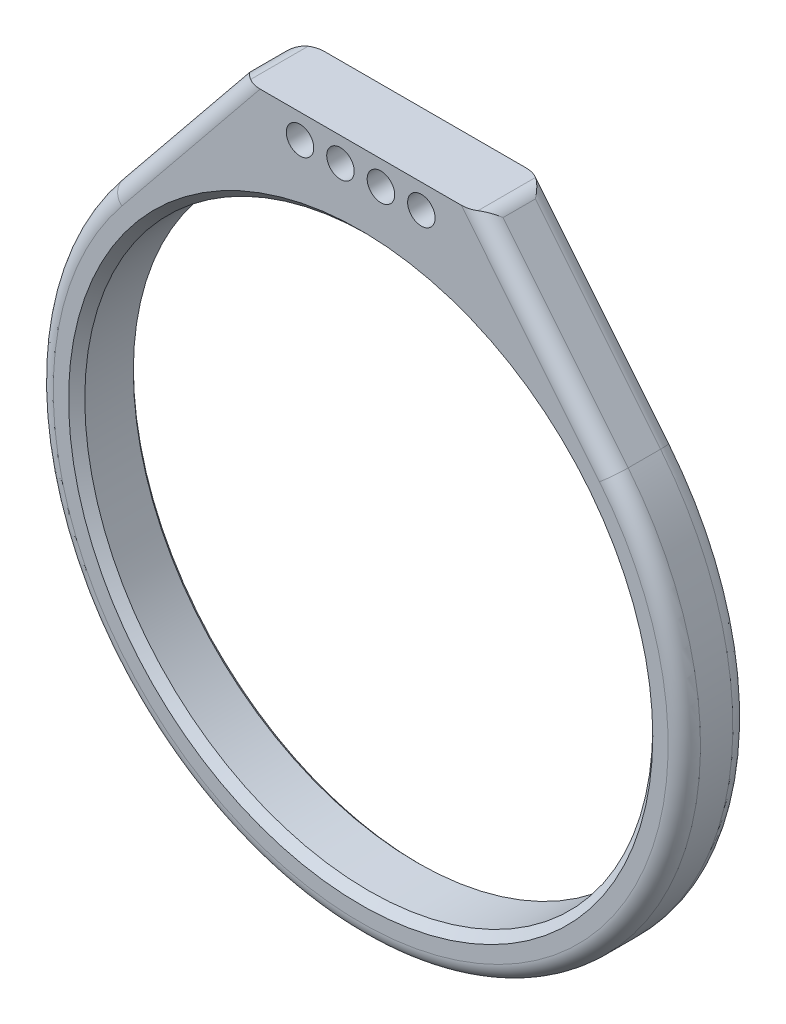
ISO-10303-21;
HEADER;
FILE_DESCRIPTION(('STEP AP214'),'2;1');
FILE_NAME('part.step','',(''),(''),'','','');
FILE_SCHEMA(('AUTOMOTIVE_DESIGN { 1 0 10303 214 1 1 1 1 }'));
ENDSEC;
DATA;
#1=APPLICATION_CONTEXT('core data for automotive mechanical design processes');
#2=APPLICATION_PROTOCOL_DEFINITION('international standard','automotive_design',2000,#1);
#3=PRODUCT_CONTEXT('',#1,'mechanical');
#4=PRODUCT('Part','Part','',(#3));
#5=PRODUCT_RELATED_PRODUCT_CATEGORY('part','',(#4));
#6=PRODUCT_DEFINITION_FORMATION('','',#4);
#7=PRODUCT_DEFINITION_CONTEXT('part definition',#1,'design');
#8=PRODUCT_DEFINITION('design','',#6,#7);
#9=PRODUCT_DEFINITION_SHAPE('','',#8);
#10=(LENGTH_UNIT() NAMED_UNIT(*) SI_UNIT(.MILLI.,.METRE.));
#11=(NAMED_UNIT(*) PLANE_ANGLE_UNIT() SI_UNIT($,.RADIAN.));
#12=(NAMED_UNIT(*) SI_UNIT($,.STERADIAN.) SOLID_ANGLE_UNIT());
#13=UNCERTAINTY_MEASURE_WITH_UNIT(LENGTH_MEASURE(1.E-05),#10,'distance_accuracy_value','');
#14=(GEOMETRIC_REPRESENTATION_CONTEXT(3) GLOBAL_UNCERTAINTY_ASSIGNED_CONTEXT((#13)) GLOBAL_UNIT_ASSIGNED_CONTEXT((#10,
#11,#12)) REPRESENTATION_CONTEXT('',''));
#15=CARTESIAN_POINT('',(0.,0.,0.));
#16=DIRECTION('',(0.,0.,1.));
#17=DIRECTION('',(1.,0.,0.));
#18=AXIS2_PLACEMENT_3D('',#15,#16,#17);
#19=CARTESIAN_POINT('',(0.,0.,8.));
#20=DIRECTION('',(0.,0.,1.));
#21=DIRECTION('',(1.,0.,0.));
#22=AXIS2_PLACEMENT_3D('',#19,#20,#21);
#23=PLANE('',#22);
#24=CARTESIAN_POINT('',(0.,0.,8.));
#25=DIRECTION('',(0.,0.,1.));
#26=DIRECTION('',(1.,0.,0.));
#27=AXIS2_PLACEMENT_3D('',#24,#25,#26);
#28=CIRCLE('',#27,36.1);
#29=CARTESIAN_POINT('',(36.1,0.,8.));
#30=VERTEX_POINT('',#29);
#31=EDGE_CURVE('E135',#30,#30,#28,.F.);
#32=ORIENTED_EDGE('',*,*,#31,.T.);
#33=EDGE_LOOP('',(#32));
#34=FACE_BOUND('',#33,.T.);
#35=CARTESIAN_POINT('',(7.49999999999999,42.,8.));
#36=DIRECTION('',(0.,0.,1.));
#37=DIRECTION('',(1.,0.,0.));
#38=AXIS2_PLACEMENT_3D('',#35,#36,#37);
#39=CIRCLE('',#38,1.69999999999999);
#40=CARTESIAN_POINT('',(9.19999999999999,42.,8.));
#41=VERTEX_POINT('',#40);
#42=EDGE_CURVE('E193',#41,#41,#39,.T.);
#43=ORIENTED_EDGE('',*,*,#42,.F.);
#44=EDGE_LOOP('',(#43));
#45=FACE_BOUND('',#44,.T.);
#46=CARTESIAN_POINT('',(-2.50000000000001,42.,8.));
#47=DIRECTION('',(0.,0.,1.));
#48=DIRECTION('',(1.,0.,0.));
#49=AXIS2_PLACEMENT_3D('',#46,#47,#48);
#50=CIRCLE('',#49,1.69999999999999);
#51=CARTESIAN_POINT('',(-0.800000000000016,42.,8.));
#52=VERTEX_POINT('',#51);
#53=EDGE_CURVE('E204',#52,#52,#50,.T.);
#54=ORIENTED_EDGE('',*,*,#53,.F.);
#55=EDGE_LOOP('',(#54));
#56=FACE_BOUND('',#55,.T.);
#57=CARTESIAN_POINT('',(-7.5,42.,8.));
#58=DIRECTION('',(0.,0.,1.));
#59=DIRECTION('',(1.,0.,0.));
#60=AXIS2_PLACEMENT_3D('',#57,#58,#59);
#61=CIRCLE('',#60,1.69999999999999);
#62=CARTESIAN_POINT('',(-5.80000000000001,42.,8.));
#63=VERTEX_POINT('',#62);
#64=EDGE_CURVE('E212',#63,#63,#61,.T.);
#65=ORIENTED_EDGE('',*,*,#64,.F.);
#66=EDGE_LOOP('',(#65));
#67=FACE_BOUND('',#66,.T.);
#68=CARTESIAN_POINT('',(2.5,42.,8.));
#69=DIRECTION('',(0.,0.,1.));
#70=DIRECTION('',(1.,0.,0.));
#71=AXIS2_PLACEMENT_3D('',#68,#69,#70);
#72=CIRCLE('',#71,1.69999999999999);
#73=CARTESIAN_POINT('',(4.19999999999999,42.,8.));
#74=VERTEX_POINT('',#73);
#75=EDGE_CURVE('E218',#74,#74,#72,.T.);
#76=ORIENTED_EDGE('',*,*,#75,.F.);
#77=EDGE_LOOP('',(#76));
#78=FACE_BOUND('',#77,.T.);
#79=DIRECTION('',(-1.,0.,0.));
#80=VECTOR('',#79,1.);
#81=CARTESIAN_POINT('',(0.,45.,8.));
#82=LINE('',#81,#80);
#83=CARTESIAN_POINT('',(12.4245675738429,45.,8.));
#84=VERTEX_POINT('',#83);
#85=CARTESIAN_POINT('',(-12.4245675738429,45.,8.));
#86=VERTEX_POINT('',#85);
#87=EDGE_CURVE('E127',#84,#86,#82,.T.);
#88=ORIENTED_EDGE('',*,*,#87,.T.);
#89=DIRECTION('',(-0.630032682880241,-0.776568618025945,0.));
#90=VECTOR('',#89,1.);
#91=CARTESIAN_POINT('',(-29.5096074849859,23.9412419494491,8.));
#92=LINE('',#91,#90);
#93=CARTESIAN_POINT('',(-29.5096074849859,23.9412419494491,8.));
#94=VERTEX_POINT('',#93);
#95=EDGE_CURVE('E239',#86,#94,#92,.T.);
#96=ORIENTED_EDGE('',*,*,#95,.T.);
#97=CARTESIAN_POINT('',(0.,0.,8.));
#98=DIRECTION('',(0.,0.,1.));
#99=DIRECTION('',(1.,0.,0.));
#100=AXIS2_PLACEMENT_3D('',#97,#98,#99);
#101=CIRCLE('',#100,38.);
#102=CARTESIAN_POINT('',(29.5096074849859,23.9412419494492,8.));
#103=VERTEX_POINT('',#102);
#104=EDGE_CURVE('E130',#94,#103,#101,.T.);
#105=ORIENTED_EDGE('',*,*,#104,.T.);
#106=DIRECTION('',(-0.630032682880241,0.776568618025945,0.));
#107=VECTOR('',#106,1.);
#108=CARTESIAN_POINT('',(13.4468627639481,43.7399346342395,8.));
#109=LINE('',#108,#107);
#110=EDGE_CURVE('E124',#103,#84,#109,.T.);
#111=ORIENTED_EDGE('',*,*,#110,.T.);
#112=EDGE_LOOP('',(#88,#96,#105,#111));
#113=FACE_BOUND('',#112,.T.);
#114=ADVANCED_FACE('F45',(#34,#45,#56,#67,#78,#113),#23,.T.);
#115=CARTESIAN_POINT('',(0.,0.,0.));
#116=DIRECTION('',(0.,0.,1.));
#117=DIRECTION('',(1.,0.,0.));
#118=AXIS2_PLACEMENT_3D('',#115,#116,#117);
#119=PLANE('',#118);
#120=CARTESIAN_POINT('',(0.,0.,0.));
#121=DIRECTION('',(0.,0.,1.));
#122=DIRECTION('',(1.,0.,0.));
#123=AXIS2_PLACEMENT_3D('',#120,#121,#122);
#124=CIRCLE('',#123,36.9284271247462);
#125=CARTESIAN_POINT('',(36.9284271247462,0.,0.));
#126=VERTEX_POINT('',#125);
#127=EDGE_CURVE('E171',#126,#126,#124,.T.);
#128=ORIENTED_EDGE('',*,*,#127,.T.);
#129=EDGE_LOOP('',(#128));
#130=FACE_BOUND('',#129,.T.);
#131=CARTESIAN_POINT('',(7.49999999999999,42.,0.));
#132=DIRECTION('',(0.,0.,1.));
#133=DIRECTION('',(1.,0.,0.));
#134=AXIS2_PLACEMENT_3D('',#131,#132,#133);
#135=CIRCLE('',#134,1.7);
#136=CARTESIAN_POINT('',(9.19999999999999,42.,0.));
#137=VERTEX_POINT('',#136);
#138=EDGE_CURVE('E199',#137,#137,#135,.T.);
#139=ORIENTED_EDGE('',*,*,#138,.T.);
#140=EDGE_LOOP('',(#139));
#141=FACE_BOUND('',#140,.T.);
#142=CARTESIAN_POINT('',(-2.50000000000001,42.,0.));
#143=DIRECTION('',(0.,0.,1.));
#144=DIRECTION('',(1.,0.,0.));
#145=AXIS2_PLACEMENT_3D('',#142,#143,#144);
#146=CIRCLE('',#145,1.7);
#147=CARTESIAN_POINT('',(-0.800000000000007,42.,0.));
#148=VERTEX_POINT('',#147);
#149=EDGE_CURVE('E209',#148,#148,#146,.T.);
#150=ORIENTED_EDGE('',*,*,#149,.T.);
#151=EDGE_LOOP('',(#150));
#152=FACE_BOUND('',#151,.T.);
#153=CARTESIAN_POINT('',(-7.5,42.,0.));
#154=DIRECTION('',(0.,0.,1.));
#155=DIRECTION('',(1.,0.,0.));
#156=AXIS2_PLACEMENT_3D('',#153,#154,#155);
#157=CIRCLE('',#156,1.7);
#158=CARTESIAN_POINT('',(-5.8,42.,0.));
#159=VERTEX_POINT('',#158);
#160=EDGE_CURVE('E215',#159,#159,#157,.T.);
#161=ORIENTED_EDGE('',*,*,#160,.T.);
#162=EDGE_LOOP('',(#161));
#163=FACE_BOUND('',#162,.T.);
#164=CARTESIAN_POINT('',(2.5,42.,0.));
#165=DIRECTION('',(0.,0.,1.));
#166=DIRECTION('',(1.,0.,0.));
#167=AXIS2_PLACEMENT_3D('',#164,#165,#166);
#168=CIRCLE('',#167,1.7);
#169=CARTESIAN_POINT('',(4.2,42.,0.));
#170=VERTEX_POINT('',#169);
#171=EDGE_CURVE('E221',#170,#170,#168,.T.);
#172=ORIENTED_EDGE('',*,*,#171,.T.);
#173=EDGE_LOOP('',(#172));
#174=FACE_BOUND('',#173,.T.);
#175=CARTESIAN_POINT('',(0.,0.,0.));
#176=DIRECTION('',(0.,0.,1.));
#177=DIRECTION('',(1.,0.,0.));
#178=AXIS2_PLACEMENT_3D('',#175,#176,#177);
#179=CIRCLE('',#178,38.);
#180=CARTESIAN_POINT('',(29.5096074849859,23.9412419494492,0.));
#181=VERTEX_POINT('',#180);
#182=CARTESIAN_POINT('',(-29.5096074849859,23.9412419494491,0.));
#183=VERTEX_POINT('',#182);
#184=EDGE_CURVE('E167',#181,#183,#179,.F.);
#185=ORIENTED_EDGE('',*,*,#184,.T.);
#186=DIRECTION('',(-0.630032682880241,-0.776568618025945,0.));
#187=VECTOR('',#186,1.);
#188=CARTESIAN_POINT('',(-29.5096074849859,23.9412419494492,0.));
#189=LINE('',#188,#187);
#190=CARTESIAN_POINT('',(-12.4245675738429,45.,0.));
#191=VERTEX_POINT('',#190);
#192=EDGE_CURVE('E169',#183,#191,#189,.F.);
#193=ORIENTED_EDGE('',*,*,#192,.T.);
#194=DIRECTION('',(-1.,0.,0.));
#195=VECTOR('',#194,1.);
#196=CARTESIAN_POINT('',(-15.,45.,0.));
#197=LINE('',#196,#195);
#198=CARTESIAN_POINT('',(12.4245675738429,45.,0.));
#199=VERTEX_POINT('',#198);
#200=EDGE_CURVE('E144',#199,#191,#197,.T.);
#201=ORIENTED_EDGE('',*,*,#200,.F.);
#202=DIRECTION('',(-0.630032682880241,0.776568618025945,0.));
#203=VECTOR('',#202,1.);
#204=CARTESIAN_POINT('',(29.5096074849859,23.9412419494492,0.));
#205=LINE('',#204,#203);
#206=EDGE_CURVE('E165',#199,#181,#205,.F.);
#207=ORIENTED_EDGE('',*,*,#206,.T.);
#208=EDGE_LOOP('',(#185,#193,#201,#207));
#209=FACE_BOUND('',#208,.T.);
#210=ADVANCED_FACE('F253',(#130,#141,#152,#163,#174,#209),#119,.F.);
#211=CARTESIAN_POINT('',(-15.,45.,8.));
#212=DIRECTION('',(0.776568618025945,-0.630032682880241,0.));
#213=DIRECTION('',(0.630032682880241,0.776568618025945,0.));
#214=AXIS2_PLACEMENT_3D('',#211,#212,#213);
#215=PLANE('',#214);
#216=DIRECTION('',(0.,0.,-1.));
#217=VECTOR('',#216,1.);
#218=CARTESIAN_POINT('',(-31.0627447210378,25.2013073152096,8.));
#219=LINE('',#218,#217);
#220=CARTESIAN_POINT('',(-31.0627447210378,25.2013073152096,6.));
#221=VERTEX_POINT('',#220);
#222=CARTESIAN_POINT('',(-31.0627447210378,25.2013073152096,2.));
#223=VERTEX_POINT('',#222);
#224=EDGE_CURVE('E227',#221,#223,#219,.T.);
#225=ORIENTED_EDGE('',*,*,#224,.F.);
#226=DIRECTION('',(-0.630032682880241,-0.776568618025945,0.));
#227=VECTOR('',#226,1.);
#228=CARTESIAN_POINT('',(-15.,45.,6.));
#229=LINE('',#228,#227);
#230=CARTESIAN_POINT('',(-15.6003114109233,44.2600653657605,6.));
#231=VERTEX_POINT('',#230);
#232=EDGE_CURVE('E245',#221,#231,#229,.F.);
#233=ORIENTED_EDGE('',*,*,#232,.T.);
#234=DIRECTION('',(0.,0.,-1.));
#235=VECTOR('',#234,1.);
#236=CARTESIAN_POINT('',(-15.6003114109233,44.2600653657605,8.));
#237=LINE('',#236,#235);
#238=CARTESIAN_POINT('',(-15.6003114109233,44.2600653657605,2.));
#239=VERTEX_POINT('',#238);
#240=EDGE_CURVE('E241',#231,#239,#237,.T.);
#241=ORIENTED_EDGE('',*,*,#240,.T.);
#242=DIRECTION('',(-0.630032682880241,-0.776568618025945,0.));
#243=VECTOR('',#242,1.);
#244=CARTESIAN_POINT('',(-15.,45.,2.));
#245=LINE('',#244,#243);
#246=EDGE_CURVE('E243',#239,#223,#245,.T.);
#247=ORIENTED_EDGE('',*,*,#246,.T.);
#248=EDGE_LOOP('',(#225,#233,#241,#247));
#249=FACE_BOUND('',#248,.T.);
#250=ADVANCED_FACE('F280',(#249),#215,.F.);
#251=CARTESIAN_POINT('',(0.,0.,8.));
#252=DIRECTION('',(0.,0.,-1.));
#253=DIRECTION('',(-1.,0.,0.));
#254=AXIS2_PLACEMENT_3D('',#251,#252,#253);
#255=CYLINDRICAL_SURFACE('',#254,40.);
#256=DIRECTION('',(0.,0.,-1.));
#257=VECTOR('',#256,1.);
#258=CARTESIAN_POINT('',(31.0627447210378,25.2013073152097,8.));
#259=LINE('',#258,#257);
#260=CARTESIAN_POINT('',(31.0627447210378,25.2013073152097,6.));
#261=VERTEX_POINT('',#260);
#262=CARTESIAN_POINT('',(31.0627447210378,25.2013073152097,2.));
#263=VERTEX_POINT('',#262);
#264=EDGE_CURVE('E143',#261,#263,#259,.T.);
#265=ORIENTED_EDGE('',*,*,#264,.F.);
#266=CARTESIAN_POINT('',(0.,0.,6.));
#267=DIRECTION('',(0.,0.,1.));
#268=DIRECTION('',(1.,0.,0.));
#269=AXIS2_PLACEMENT_3D('',#266,#267,#268);
#270=CIRCLE('',#269,40.);
#271=EDGE_CURVE('E163',#261,#221,#270,.F.);
#272=ORIENTED_EDGE('',*,*,#271,.T.);
#273=ORIENTED_EDGE('',*,*,#224,.T.);
#274=CARTESIAN_POINT('',(0.,0.,2.));
#275=DIRECTION('',(0.,0.,1.));
#276=DIRECTION('',(1.,0.,0.));
#277=AXIS2_PLACEMENT_3D('',#274,#275,#276);
#278=CIRCLE('',#277,40.);
#279=EDGE_CURVE('E161',#223,#263,#278,.T.);
#280=ORIENTED_EDGE('',*,*,#279,.T.);
#281=EDGE_LOOP('',(#265,#272,#273,#280));
#282=FACE_BOUND('',#281,.T.);
#283=ADVANCED_FACE('F277',(#282),#255,.T.);
#284=CARTESIAN_POINT('',(15.,45.,8.));
#285=DIRECTION('',(-0.776568618025945,-0.630032682880241,0.));
#286=DIRECTION('',(0.630032682880241,-0.776568618025945,0.));
#287=AXIS2_PLACEMENT_3D('',#284,#285,#286);
#288=PLANE('',#287);
#289=DIRECTION('',(0.,0.,-1.));
#290=VECTOR('',#289,1.);
#291=CARTESIAN_POINT('',(15.6003114109233,44.2600653657605,8.));
#292=LINE('',#291,#290);
#293=CARTESIAN_POINT('',(15.6003114109233,44.2600653657605,2.));
#294=VERTEX_POINT('',#293);
#295=CARTESIAN_POINT('',(15.6003114109233,44.2600653657605,6.));
#296=VERTEX_POINT('',#295);
#297=EDGE_CURVE('E62',#294,#296,#292,.F.);
#298=ORIENTED_EDGE('',*,*,#297,.T.);
#299=DIRECTION('',(-0.630032682880241,0.776568618025945,0.));
#300=VECTOR('',#299,1.);
#301=CARTESIAN_POINT('',(31.0627447210378,25.2013073152097,6.));
#302=LINE('',#301,#300);
#303=EDGE_CURVE('E54',#296,#261,#302,.F.);
#304=ORIENTED_EDGE('',*,*,#303,.T.);
#305=ORIENTED_EDGE('',*,*,#264,.T.);
#306=DIRECTION('',(-0.630032682880241,0.776568618025945,0.));
#307=VECTOR('',#306,1.);
#308=CARTESIAN_POINT('',(15.,45.,2.));
#309=LINE('',#308,#307);
#310=EDGE_CURVE('E67',#263,#294,#309,.T.);
#311=ORIENTED_EDGE('',*,*,#310,.T.);
#312=EDGE_LOOP('',(#298,#304,#305,#311));
#313=FACE_BOUND('',#312,.T.);
#314=ADVANCED_FACE('F275',(#313),#288,.F.);
#315=CARTESIAN_POINT('',(-15.,45.,8.));
#316=DIRECTION('',(0.,-1.,0.));
#317=DIRECTION('',(0.,0.,-1.));
#318=AXIS2_PLACEMENT_3D('',#315,#316,#317);
#319=PLANE('',#318);
#320=DIRECTION('',(0.,0.,-1.));
#321=VECTOR('',#320,1.);
#322=CARTESIAN_POINT('',(-14.0471741748714,45.,8.));
#323=LINE('',#322,#321);
#324=CARTESIAN_POINT('',(-14.0471741748714,45.,0.446862763948111));
#325=VERTEX_POINT('',#324);
#326=CARTESIAN_POINT('',(-14.0471741748714,45.,7.55313723605189));
#327=VERTEX_POINT('',#326);
#328=EDGE_CURVE('E150',#325,#327,#323,.F.);
#329=ORIENTED_EDGE('',*,*,#328,.T.);
#330=CARTESIAN_POINT('',(-12.4245675738429,45.,6.));
#331=DIRECTION('',(0.,-1.,0.));
#332=DIRECTION('',(1.,0.,0.));
#333=AXIS2_PLACEMENT_3D('',#330,#331,#332);
#334=ELLIPSE('',#333,2.57543242615707,2.);
#335=EDGE_CURVE('E142',#327,#86,#334,.F.);
#336=ORIENTED_EDGE('',*,*,#335,.T.);
#337=ORIENTED_EDGE('',*,*,#87,.F.);
#338=CARTESIAN_POINT('',(12.4245675738429,45.,6.));
#339=DIRECTION('',(0.,-1.,0.));
#340=DIRECTION('',(1.,0.,0.));
#341=AXIS2_PLACEMENT_3D('',#338,#339,#340);
#342=ELLIPSE('',#341,2.57543242615707,2.);
#343=CARTESIAN_POINT('',(14.0471741748714,45.,7.55313723605189));
#344=VERTEX_POINT('',#343);
#345=EDGE_CURVE('E139',#84,#344,#342,.F.);
#346=ORIENTED_EDGE('',*,*,#345,.T.);
#347=DIRECTION('',(0.,0.,-1.));
#348=VECTOR('',#347,1.);
#349=CARTESIAN_POINT('',(14.0471741748714,45.,8.));
#350=LINE('',#349,#348);
#351=CARTESIAN_POINT('',(14.0471741748714,45.,0.446862763948114));
#352=VERTEX_POINT('',#351);
#353=EDGE_CURVE('E151',#344,#352,#350,.T.);
#354=ORIENTED_EDGE('',*,*,#353,.T.);
#355=CARTESIAN_POINT('',(12.4245675738429,45.,2.));
#356=DIRECTION('',(0.,-1.,0.));
#357=DIRECTION('',(-1.,0.,0.));
#358=AXIS2_PLACEMENT_3D('',#355,#356,#357);
#359=ELLIPSE('',#358,2.57543242615707,2.);
#360=EDGE_CURVE('E155',#352,#199,#359,.F.);
#361=ORIENTED_EDGE('',*,*,#360,.T.);
#362=ORIENTED_EDGE('',*,*,#200,.T.);
#363=CARTESIAN_POINT('',(-12.4245675738429,45.,2.));
#364=DIRECTION('',(0.,-1.,0.));
#365=DIRECTION('',(-1.,0.,0.));
#366=AXIS2_PLACEMENT_3D('',#363,#364,#365);
#367=ELLIPSE('',#366,2.57543242615707,2.);
#368=EDGE_CURVE('E153',#191,#325,#367,.F.);
#369=ORIENTED_EDGE('',*,*,#368,.T.);
#370=EDGE_LOOP('',(#329,#336,#337,#346,#354,#361,#362,#369));
#371=FACE_BOUND('',#370,.T.);
#372=ADVANCED_FACE('F138',(#371),#319,.F.);
#373=CARTESIAN_POINT('',(0.,0.,8.));
#374=DIRECTION('',(0.,0.,-1.));
#375=DIRECTION('',(-1.,0.,0.));
#376=AXIS2_PLACEMENT_3D('',#373,#374,#375);
#377=CYLINDRICAL_SURFACE('',#376,35.1);
#378=CARTESIAN_POINT('',(0.,0.,7.));
#379=DIRECTION('',(0.,0.,1.));
#380=DIRECTION('',(1.,0.,0.));
#381=AXIS2_PLACEMENT_3D('',#378,#379,#380);
#382=CIRCLE('',#381,35.1);
#383=CARTESIAN_POINT('',(35.1,0.,7.));
#384=VERTEX_POINT('',#383);
#385=EDGE_CURVE('E233',#384,#384,#382,.T.);
#386=ORIENTED_EDGE('',*,*,#385,.T.);
#387=EDGE_LOOP('',(#386));
#388=FACE_BOUND('',#387,.T.);
#389=CARTESIAN_POINT('',(0.,0.,0.999999999999994));
#390=DIRECTION('',(0.,0.,1.));
#391=DIRECTION('',(1.,0.,0.));
#392=AXIS2_PLACEMENT_3D('',#389,#390,#391);
#393=CIRCLE('',#392,35.1);
#394=CARTESIAN_POINT('',(35.1,0.,0.999999999999994));
#395=VERTEX_POINT('',#394);
#396=EDGE_CURVE('E230',#395,#395,#393,.F.);
#397=ORIENTED_EDGE('',*,*,#396,.T.);
#398=EDGE_LOOP('',(#397));
#399=FACE_BOUND('',#398,.T.);
#400=ADVANCED_FACE('F298',(#388,#399),#377,.F.);
#401=CARTESIAN_POINT('',(2.5,42.,8.));
#402=DIRECTION('',(0.,0.,1.));
#403=DIRECTION('',(1.,0.,0.));
#404=AXIS2_PLACEMENT_3D('',#401,#402,#403);
#405=CYLINDRICAL_SURFACE('',#404,1.69999999999999);
#406=ORIENTED_EDGE('',*,*,#171,.F.);
#407=EDGE_LOOP('',(#406));
#408=FACE_BOUND('',#407,.T.);
#409=ORIENTED_EDGE('',*,*,#75,.T.);
#410=EDGE_LOOP('',(#409));
#411=FACE_BOUND('',#410,.T.);
#412=ADVANCED_FACE('F319',(#408,#411),#405,.F.);
#413=CARTESIAN_POINT('',(-7.5,42.,8.));
#414=DIRECTION('',(0.,0.,1.));
#415=DIRECTION('',(1.,0.,0.));
#416=AXIS2_PLACEMENT_3D('',#413,#414,#415);
#417=CYLINDRICAL_SURFACE('',#416,1.69999999999999);
#418=ORIENTED_EDGE('',*,*,#160,.F.);
#419=EDGE_LOOP('',(#418));
#420=FACE_BOUND('',#419,.T.);
#421=ORIENTED_EDGE('',*,*,#64,.T.);
#422=EDGE_LOOP('',(#421));
#423=FACE_BOUND('',#422,.T.);
#424=ADVANCED_FACE('F328',(#420,#423),#417,.F.);
#425=CARTESIAN_POINT('',(-2.50000000000001,42.,8.));
#426=DIRECTION('',(0.,0.,1.));
#427=DIRECTION('',(1.,0.,0.));
#428=AXIS2_PLACEMENT_3D('',#425,#426,#427);
#429=CYLINDRICAL_SURFACE('',#428,1.69999999999999);
#430=ORIENTED_EDGE('',*,*,#149,.F.);
#431=EDGE_LOOP('',(#430));
#432=FACE_BOUND('',#431,.T.);
#433=ORIENTED_EDGE('',*,*,#53,.T.);
#434=EDGE_LOOP('',(#433));
#435=FACE_BOUND('',#434,.T.);
#436=ADVANCED_FACE('F335',(#432,#435),#429,.F.);
#437=CARTESIAN_POINT('',(7.49999999999999,42.,8.));
#438=DIRECTION('',(0.,0.,1.));
#439=DIRECTION('',(1.,0.,0.));
#440=AXIS2_PLACEMENT_3D('',#437,#438,#439);
#441=CYLINDRICAL_SURFACE('',#440,1.69999999999999);
#442=ORIENTED_EDGE('',*,*,#138,.F.);
#443=EDGE_LOOP('',(#442));
#444=FACE_BOUND('',#443,.T.);
#445=ORIENTED_EDGE('',*,*,#42,.T.);
#446=EDGE_LOOP('',(#445));
#447=FACE_BOUND('',#446,.T.);
#448=ADVANCED_FACE('F343',(#444,#447),#441,.F.);
#449=CARTESIAN_POINT('',(0.,0.,7.));
#450=DIRECTION('',(0.,0.,1.));
#451=DIRECTION('',(1.,0.,0.));
#452=AXIS2_PLACEMENT_3D('',#449,#450,#451);
#453=CONICAL_SURFACE('',#452,35.1,0.785398163397452);
#454=ORIENTED_EDGE('',*,*,#31,.F.);
#455=EDGE_LOOP('',(#454));
#456=FACE_BOUND('',#455,.T.);
#457=ORIENTED_EDGE('',*,*,#385,.F.);
#458=EDGE_LOOP('',(#457));
#459=FACE_BOUND('',#458,.T.);
#460=ADVANCED_FACE('F350',(#456,#459),#453,.F.);
#461=CARTESIAN_POINT('',(0.,0.,0.));
#462=DIRECTION('',(0.,0.,-1.));
#463=DIRECTION('',(-1.,0.,0.));
#464=AXIS2_PLACEMENT_3D('',#461,#462,#463);
#465=CONICAL_SURFACE('',#464,36.1,0.785398163397438);
#466=CARTESIAN_POINT('',(0.,0.,0.585786437626919));
#467=DIRECTION('',(0.,0.,-1.));
#468=DIRECTION('',(-1.,0.,0.));
#469=AXIS2_PLACEMENT_3D('',#466,#467,#468);
#470=CIRCLE('',#469,35.5142135623731);
#471=CARTESIAN_POINT('',(-35.5142135623731,0.,0.585786437626919));
#472=VERTEX_POINT('',#471);
#473=EDGE_CURVE('E11',#472,#472,#470,.T.);
#474=ORIENTED_EDGE('',*,*,#473,.T.);
#475=EDGE_LOOP('',(#474));
#476=FACE_BOUND('',#475,.T.);
#477=ORIENTED_EDGE('',*,*,#396,.F.);
#478=EDGE_LOOP('',(#477));
#479=FACE_BOUND('',#478,.T.);
#480=ADVANCED_FACE('F357',(#476,#479),#465,.F.);
#481=CARTESIAN_POINT('',(13.4468627639481,43.7399346342395,2.));
#482=DIRECTION('',(-0.630032682880241,0.776568618025945,0.));
#483=DIRECTION('',(-0.776568618025945,-0.630032682880241,0.));
#484=AXIS2_PLACEMENT_3D('',#481,#482,#483);
#485=CYLINDRICAL_SURFACE('',#484,2.);
#486=CARTESIAN_POINT('',(14.0471741748714,43.,2.));
#487=DIRECTION('',(-0.445500382433772,0.549116935862811,0.707106781186547));
#488=DIRECTION('',(-0.445500382433772,0.549116935862811,-0.707106781186547));
#489=AXIS2_PLACEMENT_3D('',#486,#487,#488);
#490=ELLIPSE('',#489,2.82842712474619,2.);
#491=EDGE_CURVE('E189',#294,#352,#490,.T.);
#492=ORIENTED_EDGE('',*,*,#491,.F.);
#493=ORIENTED_EDGE('',*,*,#310,.F.);
#494=CARTESIAN_POINT('',(29.5096074849859,23.9412419494492,2.));
#495=DIRECTION('',(0.63003268288024,-0.776568618025946,0.));
#496=DIRECTION('',(0.776568618025946,0.63003268288024,0.));
#497=AXIS2_PLACEMENT_3D('',#494,#495,#496);
#498=CIRCLE('',#497,2.);
#499=EDGE_CURVE('E49',#181,#263,#498,.T.);
#500=ORIENTED_EDGE('',*,*,#499,.F.);
#501=ORIENTED_EDGE('',*,*,#206,.F.);
#502=ORIENTED_EDGE('',*,*,#360,.F.);
#503=EDGE_LOOP('',(#492,#493,#500,#501,#502));
#504=FACE_BOUND('',#503,.T.);
#505=ADVANCED_FACE('F255',(#504),#485,.T.);
#506=CARTESIAN_POINT('',(0.,0.,2.));
#507=DIRECTION('',(0.,0.,1.));
#508=DIRECTION('',(1.,0.,0.));
#509=AXIS2_PLACEMENT_3D('',#506,#507,#508);
#510=TOROIDAL_SURFACE('',#509,38.,2.);
#511=ORIENTED_EDGE('',*,*,#499,.T.);
#512=ORIENTED_EDGE('',*,*,#279,.F.);
#513=CARTESIAN_POINT('',(-29.5096074849859,23.9412419494491,2.));
#514=DIRECTION('',(0.630032682880241,0.776568618025945,0.));
#515=DIRECTION('',(-0.776568618025945,0.630032682880241,0.));
#516=AXIS2_PLACEMENT_3D('',#513,#514,#515);
#517=CIRCLE('',#516,2.);
#518=EDGE_CURVE('E187',#183,#223,#517,.T.);
#519=ORIENTED_EDGE('',*,*,#518,.F.);
#520=ORIENTED_EDGE('',*,*,#184,.F.);
#521=EDGE_LOOP('',(#511,#512,#519,#520));
#522=FACE_BOUND('',#521,.T.);
#523=ADVANCED_FACE('F257',(#522),#510,.T.);
#524=CARTESIAN_POINT('',(14.0471741748714,43.,8.));
#525=DIRECTION('',(0.,0.,-1.));
#526=DIRECTION('',(-1.,0.,0.));
#527=AXIS2_PLACEMENT_3D('',#524,#525,#526);
#528=CYLINDRICAL_SURFACE('',#527,2.);
#529=ORIENTED_EDGE('',*,*,#491,.T.);
#530=ORIENTED_EDGE('',*,*,#353,.F.);
#531=CARTESIAN_POINT('',(14.0471741748714,43.,6.));
#532=DIRECTION('',(0.445500382433772,-0.549116935862811,0.707106781186547));
#533=DIRECTION('',(0.445500382433772,-0.549116935862811,-0.707106781186547));
#534=AXIS2_PLACEMENT_3D('',#531,#532,#533);
#535=ELLIPSE('',#534,2.82842712474619,2.);
#536=EDGE_CURVE('E149',#296,#344,#535,.T.);
#537=ORIENTED_EDGE('',*,*,#536,.F.);
#538=ORIENTED_EDGE('',*,*,#297,.F.);
#539=EDGE_LOOP('',(#529,#530,#537,#538));
#540=FACE_BOUND('',#539,.T.);
#541=ADVANCED_FACE('F375',(#540),#528,.T.);
#542=CARTESIAN_POINT('',(-13.4468627639481,43.7399346342395,2.));
#543=DIRECTION('',(-0.630032682880241,-0.776568618025945,0.));
#544=DIRECTION('',(0.776568618025945,-0.630032682880241,0.));
#545=AXIS2_PLACEMENT_3D('',#542,#543,#544);
#546=CYLINDRICAL_SURFACE('',#545,2.);
#547=ORIENTED_EDGE('',*,*,#518,.T.);
#548=ORIENTED_EDGE('',*,*,#246,.F.);
#549=CARTESIAN_POINT('',(-14.0471741748714,43.,2.));
#550=DIRECTION('',(-0.445500382433772,-0.549116935862811,-0.707106781186547));
#551=DIRECTION('',(0.445500382433772,0.549116935862811,-0.707106781186547));
#552=AXIS2_PLACEMENT_3D('',#549,#550,#551);
#553=ELLIPSE('',#552,2.82842712474619,2.);
#554=EDGE_CURVE('E183',#325,#239,#553,.F.);
#555=ORIENTED_EDGE('',*,*,#554,.F.);
#556=ORIENTED_EDGE('',*,*,#368,.F.);
#557=ORIENTED_EDGE('',*,*,#192,.F.);
#558=EDGE_LOOP('',(#547,#548,#555,#556,#557));
#559=FACE_BOUND('',#558,.T.);
#560=ADVANCED_FACE('F260',(#559),#546,.T.);
#561=CARTESIAN_POINT('',(29.5096074849859,23.9412419494492,6.));
#562=DIRECTION('',(0.630032682880241,-0.776568618025945,0.));
#563=DIRECTION('',(0.776568618025945,0.630032682880241,0.));
#564=AXIS2_PLACEMENT_3D('',#561,#562,#563);
#565=CYLINDRICAL_SURFACE('',#564,2.);
#566=ORIENTED_EDGE('',*,*,#345,.F.);
#567=ORIENTED_EDGE('',*,*,#110,.F.);
#568=CARTESIAN_POINT('',(29.5096074849859,23.9412419494492,6.));
#569=DIRECTION('',(0.630032682880241,-0.776568618025945,0.));
#570=DIRECTION('',(0.776568618025945,0.630032682880241,0.));
#571=AXIS2_PLACEMENT_3D('',#568,#569,#570);
#572=CIRCLE('',#571,2.);
#573=EDGE_CURVE('E181',#261,#103,#572,.T.);
#574=ORIENTED_EDGE('',*,*,#573,.F.);
#575=ORIENTED_EDGE('',*,*,#303,.F.);
#576=ORIENTED_EDGE('',*,*,#536,.T.);
#577=EDGE_LOOP('',(#566,#567,#574,#575,#576));
#578=FACE_BOUND('',#577,.T.);
#579=ADVANCED_FACE('F147',(#578),#565,.T.);
#580=CARTESIAN_POINT('',(-14.0471741748714,43.,8.));
#581=DIRECTION('',(0.,0.,-1.));
#582=DIRECTION('',(-1.,0.,0.));
#583=AXIS2_PLACEMENT_3D('',#580,#581,#582);
#584=CYLINDRICAL_SURFACE('',#583,2.);
#585=ORIENTED_EDGE('',*,*,#554,.T.);
#586=ORIENTED_EDGE('',*,*,#240,.F.);
#587=CARTESIAN_POINT('',(-14.0471741748714,43.,6.));
#588=DIRECTION('',(0.445500382433772,0.549116935862811,-0.707106781186547));
#589=DIRECTION('',(-0.445500382433772,-0.549116935862811,-0.707106781186547));
#590=AXIS2_PLACEMENT_3D('',#587,#588,#589);
#591=ELLIPSE('',#590,2.82842712474619,2.);
#592=EDGE_CURVE('E179',#327,#231,#591,.F.);
#593=ORIENTED_EDGE('',*,*,#592,.F.);
#594=ORIENTED_EDGE('',*,*,#328,.F.);
#595=EDGE_LOOP('',(#585,#586,#593,#594));
#596=FACE_BOUND('',#595,.T.);
#597=ADVANCED_FACE('F266',(#596),#584,.T.);
#598=CARTESIAN_POINT('',(0.,0.,6.));
#599=DIRECTION('',(0.,0.,1.));
#600=DIRECTION('',(1.,0.,0.));
#601=AXIS2_PLACEMENT_3D('',#598,#599,#600);
#602=TOROIDAL_SURFACE('',#601,38.,2.);
#603=ORIENTED_EDGE('',*,*,#573,.T.);
#604=ORIENTED_EDGE('',*,*,#104,.F.);
#605=CARTESIAN_POINT('',(-29.5096074849859,23.9412419494491,6.));
#606=DIRECTION('',(0.630032682880241,0.776568618025945,0.));
#607=DIRECTION('',(-0.776568618025945,0.630032682880241,0.));
#608=AXIS2_PLACEMENT_3D('',#605,#606,#607);
#609=CIRCLE('',#608,2.);
#610=EDGE_CURVE('E177',#221,#94,#609,.T.);
#611=ORIENTED_EDGE('',*,*,#610,.F.);
#612=ORIENTED_EDGE('',*,*,#271,.F.);
#613=EDGE_LOOP('',(#603,#604,#611,#612));
#614=FACE_BOUND('',#613,.T.);
#615=ADVANCED_FACE('F273',(#614),#602,.T.);
#616=CARTESIAN_POINT('',(-29.5096074849859,23.9412419494492,6.));
#617=DIRECTION('',(0.630032682880241,0.776568618025945,0.));
#618=DIRECTION('',(-0.776568618025945,0.630032682880241,0.));
#619=AXIS2_PLACEMENT_3D('',#616,#617,#618);
#620=CYLINDRICAL_SURFACE('',#619,2.);
#621=ORIENTED_EDGE('',*,*,#592,.T.);
#622=ORIENTED_EDGE('',*,*,#232,.F.);
#623=ORIENTED_EDGE('',*,*,#610,.T.);
#624=ORIENTED_EDGE('',*,*,#95,.F.);
#625=ORIENTED_EDGE('',*,*,#335,.F.);
#626=EDGE_LOOP('',(#621,#622,#623,#624,#625));
#627=FACE_BOUND('',#626,.T.);
#628=ADVANCED_FACE('F269',(#627),#620,.T.);
#629=CARTESIAN_POINT('',(0.,0.,2.));
#630=DIRECTION('',(0.,0.,1.));
#631=DIRECTION('',(1.,0.,0.));
#632=AXIS2_PLACEMENT_3D('',#629,#630,#631);
#633=TOROIDAL_SURFACE('',#632,36.9284271247462,2.);
#634=ORIENTED_EDGE('',*,*,#473,.F.);
#635=EDGE_LOOP('',(#634));
#636=FACE_BOUND('',#635,.T.);
#637=ORIENTED_EDGE('',*,*,#127,.F.);
#638=EDGE_LOOP('',(#637));
#639=FACE_BOUND('',#638,.T.);
#640=ADVANCED_FACE('F47',(#636,#639),#633,.T.);
#641=CLOSED_SHELL('',(#114,#210,#250,#283,#314,#372,#400,#412,#424,#436,#448,#460,#480,#505,
#523,#541,#560,#579,#597,#615,#628,#640));
#642=MANIFOLD_SOLID_BREP('B2',#641);
#643=ADVANCED_BREP_SHAPE_REPRESENTATION('',(#18,#642),#14);
#644=SHAPE_DEFINITION_REPRESENTATION(#9,#643);
ENDSEC;
END-ISO-10303-21;
